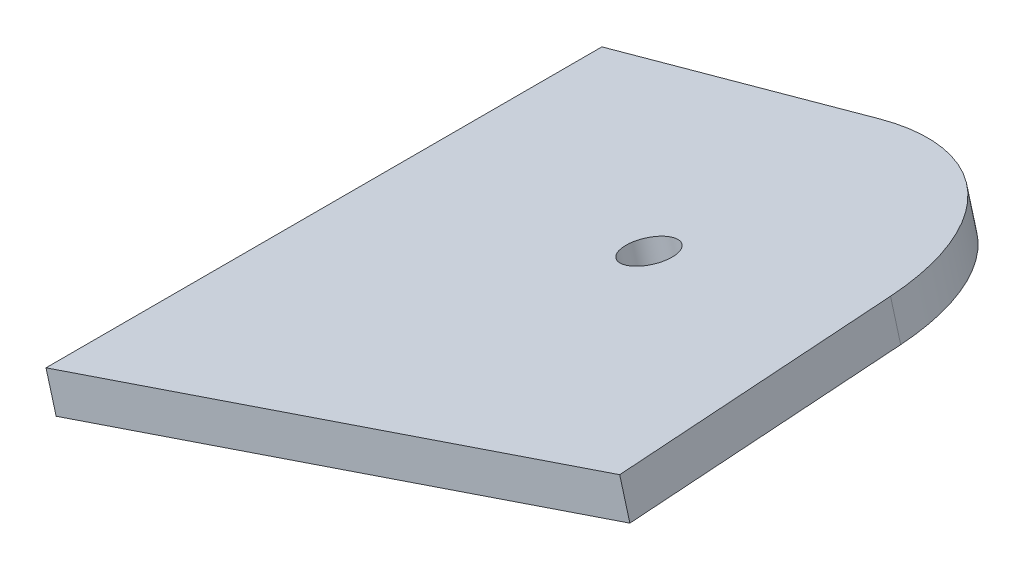
ISO-10303-21;
HEADER;
FILE_DESCRIPTION(('STEP AP214'),'2;1');
FILE_NAME('part.step','',(''),(''),'','','');
FILE_SCHEMA(('AUTOMOTIVE_DESIGN { 1 0 10303 214 1 1 1 1 }'));
ENDSEC;
DATA;
#1=APPLICATION_CONTEXT('core data for automotive mechanical design processes');
#2=APPLICATION_PROTOCOL_DEFINITION('international standard','automotive_design',2000,#1);
#3=PRODUCT_CONTEXT('',#1,'mechanical');
#4=PRODUCT('Part','Part','',(#3));
#5=PRODUCT_RELATED_PRODUCT_CATEGORY('part','',(#4));
#6=PRODUCT_DEFINITION_FORMATION('','',#4);
#7=PRODUCT_DEFINITION_CONTEXT('part definition',#1,'design');
#8=PRODUCT_DEFINITION('design','',#6,#7);
#9=PRODUCT_DEFINITION_SHAPE('','',#8);
#10=(LENGTH_UNIT() NAMED_UNIT(*) SI_UNIT(.MILLI.,.METRE.));
#11=(NAMED_UNIT(*) PLANE_ANGLE_UNIT() SI_UNIT($,.RADIAN.));
#12=(NAMED_UNIT(*) SI_UNIT($,.STERADIAN.) SOLID_ANGLE_UNIT());
#13=UNCERTAINTY_MEASURE_WITH_UNIT(LENGTH_MEASURE(1.E-05),#10,'distance_accuracy_value','');
#14=(GEOMETRIC_REPRESENTATION_CONTEXT(3) GLOBAL_UNCERTAINTY_ASSIGNED_CONTEXT((#13)) GLOBAL_UNIT_ASSIGNED_CONTEXT((#10,
#11,#12)) REPRESENTATION_CONTEXT('',''));
#15=CARTESIAN_POINT('',(0.,0.,0.));
#16=DIRECTION('',(0.,0.,1.));
#17=DIRECTION('',(1.,0.,0.));
#18=AXIS2_PLACEMENT_3D('',#15,#16,#17);
#19=CARTESIAN_POINT('',(-530.471128500836,55.5710730553242,45.8045757603859));
#20=DIRECTION('',(-0.96003686260803,-0.264378698649397,0.0918320539582106));
#21=DIRECTION('',(0.265500568767691,-0.964110703178859,0.));
#22=AXIS2_PLACEMENT_3D('',#19,#20,#21);
#23=PLANE('',#22);
#24=DIRECTION('',(-0.0885362661160089,-0.0243814625570103,-0.995774509548129));
#25=VECTOR('',#24,1.);
#26=CARTESIAN_POINT('',(-529.796757056166,53.1222318692499,45.8045757603859));
#27=LINE('',#26,#25);
#28=CARTESIAN_POINT('',(-517.882221289095,56.4033032361896,179.808318299092));
#29=VERTEX_POINT('',#28);
#30=CARTESIAN_POINT('',(-519.636301793386,55.9202577000101,160.080033715925));
#31=VERTEX_POINT('',#30);
#32=EDGE_CURVE('E113',#29,#31,#27,.T.);
#33=ORIENTED_EDGE('',*,*,#32,.T.);
#34=DIRECTION('',(0.265500568767691,-0.964110703178859,0.));
#35=VECTOR('',#34,1.);
#36=CARTESIAN_POINT('',(-520.310673238056,58.3690988860844,160.080033715925));
#37=LINE('',#36,#35);
#38=CARTESIAN_POINT('',(-520.310673238056,58.3690988860844,160.080033715925));
#39=VERTEX_POINT('',#38);
#40=EDGE_CURVE('E11',#39,#31,#37,.T.);
#41=ORIENTED_EDGE('',*,*,#40,.F.);
#42=DIRECTION('',(-0.0885362661160089,-0.0243814625570103,-0.995774509548129));
#43=VECTOR('',#42,1.);
#44=CARTESIAN_POINT('',(-530.471128500836,55.5710730553242,45.8045757603859));
#45=LINE('',#44,#43);
#46=CARTESIAN_POINT('',(-518.556592733765,58.8521444222639,179.808318299092));
#47=VERTEX_POINT('',#46);
#48=EDGE_CURVE('E130',#47,#39,#45,.T.);
#49=ORIENTED_EDGE('',*,*,#48,.F.);
#50=DIRECTION('',(0.265500568767691,-0.964110703178859,0.));
#51=VECTOR('',#50,1.);
#52=CARTESIAN_POINT('',(-518.556592733765,58.8521444222639,179.808318299092));
#53=LINE('',#52,#51);
#54=EDGE_CURVE('E106',#47,#29,#53,.T.);
#55=ORIENTED_EDGE('',*,*,#54,.T.);
#56=EDGE_LOOP('',(#33,#41,#49,#55));
#57=FACE_BOUND('',#56,.T.);
#58=ADVANCED_FACE('F36',(#57),#23,.F.);
#59=CARTESIAN_POINT('',(-534.941635024202,54.3399675186675,161.479554218248));
#60=DIRECTION('',(0.265500568767691,-0.964110703178859,0.));
#61=DIRECTION('',(0.964110703178859,0.265500568767691,0.));
#62=AXIS2_PLACEMENT_3D('',#59,#60,#61);
#63=CYLINDRICAL_SURFACE('',#62,15.2400000000002);
#64=CARTESIAN_POINT('',(-534.267263579532,51.8911263325932,161.479554218248));
#65=DIRECTION('',(-0.265500568767691,0.964110703178859,0.));
#66=DIRECTION('',(-0.964110703178859,-0.265500568767691,0.));
#67=AXIS2_PLACEMENT_3D('',#64,#65,#66);
#68=CIRCLE('',#67,15.2400000000002);
#69=CARTESIAN_POINT('',(-534.267263579532,51.8911263325932,146.239554218248));
#70=VERTEX_POINT('',#69);
#71=EDGE_CURVE('E116',#31,#70,#68,.T.);
#72=ORIENTED_EDGE('',*,*,#71,.T.);
#73=DIRECTION('',(0.265500568767691,-0.964110703178859,0.));
#74=VECTOR('',#73,1.);
#75=CARTESIAN_POINT('',(-534.941635024202,54.3399675186675,146.239554218248));
#76=LINE('',#75,#74);
#77=CARTESIAN_POINT('',(-534.941635024202,54.3399675186675,146.239554218248));
#78=VERTEX_POINT('',#77);
#79=EDGE_CURVE('E45',#78,#70,#76,.T.);
#80=ORIENTED_EDGE('',*,*,#79,.F.);
#81=CARTESIAN_POINT('',(-534.941635024202,54.3399675186675,161.479554218248));
#82=DIRECTION('',(-0.265500568767691,0.964110703178859,0.));
#83=DIRECTION('',(-0.964110703178859,-0.265500568767691,0.));
#84=AXIS2_PLACEMENT_3D('',#81,#82,#83);
#85=CIRCLE('',#84,15.2400000000002);
#86=EDGE_CURVE('E83',#39,#78,#85,.T.);
#87=ORIENTED_EDGE('',*,*,#86,.F.);
#88=ORIENTED_EDGE('',*,*,#40,.T.);
#89=EDGE_LOOP('',(#72,#80,#87,#88));
#90=FACE_BOUND('',#89,.T.);
#91=ADVANCED_FACE('F144',(#90),#63,.T.);
#92=CARTESIAN_POINT('',(-51.6178380571328,187.439561341879,146.239554218246));
#93=DIRECTION('',(0.,0.,1.));
#94=DIRECTION('',(1.,0.,0.));
#95=AXIS2_PLACEMENT_3D('',#92,#93,#94);
#96=PLANE('',#95);
#97=DIRECTION('',(-0.964110703178859,-0.265500568767691,0.));
#98=VECTOR('',#97,1.);
#99=CARTESIAN_POINT('',(-50.9434666124628,184.990720155805,146.239554218246));
#100=LINE('',#99,#98);
#101=CARTESIAN_POINT('',(-552.63357247509,46.8333404975687,146.239554218248));
#102=VERTEX_POINT('',#101);
#103=EDGE_CURVE('E99',#70,#102,#100,.T.);
#104=ORIENTED_EDGE('',*,*,#103,.T.);
#105=DIRECTION('',(0.265500568767691,-0.964110703178859,0.));
#106=VECTOR('',#105,1.);
#107=CARTESIAN_POINT('',(-553.30794391976,49.282181683643,146.239554218248));
#108=LINE('',#107,#106);
#109=CARTESIAN_POINT('',(-553.30794391976,49.282181683643,146.239554218248));
#110=VERTEX_POINT('',#109);
#111=EDGE_CURVE('E96',#110,#102,#108,.T.);
#112=ORIENTED_EDGE('',*,*,#111,.F.);
#113=DIRECTION('',(-0.964110703178859,-0.265500568767691,0.));
#114=VECTOR('',#113,1.);
#115=CARTESIAN_POINT('',(-51.6178380571328,187.439561341879,146.239554218246));
#116=LINE('',#115,#114);
#117=EDGE_CURVE('E87',#78,#110,#116,.T.);
#118=ORIENTED_EDGE('',*,*,#117,.F.);
#119=ORIENTED_EDGE('',*,*,#79,.T.);
#120=EDGE_LOOP('',(#104,#112,#118,#119));
#121=FACE_BOUND('',#120,.T.);
#122=ADVANCED_FACE('F97',(#121),#96,.F.);
#123=CARTESIAN_POINT('',(-553.30794391976,49.282181683643,0.));
#124=DIRECTION('',(-0.964110703178859,-0.265500568767691,0.));
#125=DIRECTION('',(0.265500568767691,-0.964110703178859,0.));
#126=AXIS2_PLACEMENT_3D('',#123,#124,#125);
#127=PLANE('',#126);
#128=DIRECTION('',(0.,0.,-1.));
#129=VECTOR('',#128,1.);
#130=CARTESIAN_POINT('',(-552.63357247509,46.8333404975687,0.));
#131=LINE('',#130,#129);
#132=CARTESIAN_POINT('',(-552.63357247509,46.8333404975687,183.13244894608));
#133=VERTEX_POINT('',#132);
#134=EDGE_CURVE('E119',#133,#102,#131,.T.);
#135=ORIENTED_EDGE('',*,*,#134,.F.);
#136=DIRECTION('',(0.265500568767691,-0.964110703178859,0.));
#137=VECTOR('',#136,1.);
#138=CARTESIAN_POINT('',(-553.30794391976,49.282181683643,183.13244894608));
#139=LINE('',#138,#137);
#140=CARTESIAN_POINT('',(-553.30794391976,49.282181683643,183.13244894608));
#141=VERTEX_POINT('',#140);
#142=EDGE_CURVE('E72',#141,#133,#139,.T.);
#143=ORIENTED_EDGE('',*,*,#142,.F.);
#144=DIRECTION('',(0.,0.,-1.));
#145=VECTOR('',#144,1.);
#146=CARTESIAN_POINT('',(-553.30794391976,49.282181683643,0.));
#147=LINE('',#146,#145);
#148=EDGE_CURVE('E91',#141,#110,#147,.T.);
#149=ORIENTED_EDGE('',*,*,#148,.T.);
#150=ORIENTED_EDGE('',*,*,#111,.T.);
#151=EDGE_LOOP('',(#135,#143,#149,#150));
#152=FACE_BOUND('',#151,.T.);
#153=ADVANCED_FACE('F104',(#152),#127,.T.);
#154=CARTESIAN_POINT('',(-534.941635024202,54.3399675186675,161.479554218248));
#155=DIRECTION('',(0.265500568767691,-0.964110703178859,0.));
#156=DIRECTION('',(0.964110703178859,0.265500568767691,0.));
#157=AXIS2_PLACEMENT_3D('',#154,#155,#156);
#158=CYLINDRICAL_SURFACE('',#157,1.58750000000036);
#159=CARTESIAN_POINT('',(-534.941635024202,54.3399675186675,161.479554218248));
#160=DIRECTION('',(-0.265500568767691,0.964110703178859,0.));
#161=DIRECTION('',(-0.964110703178859,-0.265500568767691,0.));
#162=AXIS2_PLACEMENT_3D('',#159,#160,#161);
#163=CIRCLE('',#162,1.58750000000036);
#164=CARTESIAN_POINT('',(-536.472160765499,53.9184853657487,161.479554218248));
#165=VERTEX_POINT('',#164);
#166=EDGE_CURVE('E122',#165,#165,#163,.T.);
#167=ORIENTED_EDGE('',*,*,#166,.T.);
#168=EDGE_LOOP('',(#167));
#169=FACE_BOUND('',#168,.T.);
#170=CARTESIAN_POINT('',(-534.267263579532,51.8911263325932,161.479554218248));
#171=DIRECTION('',(-0.265500568767691,0.964110703178859,0.));
#172=DIRECTION('',(-0.964110703178859,-0.265500568767691,0.));
#173=AXIS2_PLACEMENT_3D('',#170,#171,#172);
#174=CIRCLE('',#173,1.58750000000036);
#175=CARTESIAN_POINT('',(-535.797789320829,51.4696441796744,161.479554218248));
#176=VERTEX_POINT('',#175);
#177=EDGE_CURVE('E110',#176,#176,#174,.T.);
#178=ORIENTED_EDGE('',*,*,#177,.F.);
#179=EDGE_LOOP('',(#178));
#180=FACE_BOUND('',#179,.T.);
#181=ADVANCED_FACE('F38',(#169,#180),#158,.F.);
#182=CARTESIAN_POINT('',(-39.7033022900621,190.720632708819,134.003742538703));
#183=DIRECTION('',(-0.0885362661160153,-0.0243814625570119,-0.995774509548129));
#184=DIRECTION('',(-0.996070613494916,0.,0.0885625932991074));
#185=AXIS2_PLACEMENT_3D('',#182,#183,#184);
#186=PLANE('',#185);
#187=DIRECTION('',(0.960036862608029,0.264378698649397,-0.0918320539582173));
#188=VECTOR('',#187,1.);
#189=CARTESIAN_POINT('',(-39.0289308453923,188.271791522744,134.003742538703));
#190=LINE('',#189,#188);
#191=EDGE_CURVE('E75',#133,#29,#190,.T.);
#192=ORIENTED_EDGE('',*,*,#191,.T.);
#193=ORIENTED_EDGE('',*,*,#54,.F.);
#194=DIRECTION('',(0.960036862608029,0.264378698649397,-0.0918320539582173));
#195=VECTOR('',#194,1.);
#196=CARTESIAN_POINT('',(-39.7033022900621,190.720632708819,134.003742538703));
#197=LINE('',#196,#195);
#198=EDGE_CURVE('E53',#141,#47,#197,.T.);
#199=ORIENTED_EDGE('',*,*,#198,.F.);
#200=ORIENTED_EDGE('',*,*,#142,.T.);
#201=EDGE_LOOP('',(#192,#193,#199,#200));
#202=FACE_BOUND('',#201,.T.);
#203=ADVANCED_FACE('F131',(#202),#186,.F.);
#204=CARTESIAN_POINT('',(-51.617838057133,187.439561341879,-2.77555756156289E-13));
#205=DIRECTION('',(-0.265500568767691,0.964110703178859,0.));
#206=DIRECTION('',(-0.964110703178859,-0.265500568767691,0.));
#207=AXIS2_PLACEMENT_3D('',#204,#205,#206);
#208=PLANE('',#207);
#209=ORIENTED_EDGE('',*,*,#166,.F.);
#210=EDGE_LOOP('',(#209));
#211=FACE_BOUND('',#210,.T.);
#212=ORIENTED_EDGE('',*,*,#48,.T.);
#213=ORIENTED_EDGE('',*,*,#86,.T.);
#214=ORIENTED_EDGE('',*,*,#117,.T.);
#215=ORIENTED_EDGE('',*,*,#148,.F.);
#216=ORIENTED_EDGE('',*,*,#198,.T.);
#217=EDGE_LOOP('',(#212,#213,#214,#215,#216));
#218=FACE_BOUND('',#217,.T.);
#219=ADVANCED_FACE('F89',(#211,#218),#208,.T.);
#220=CARTESIAN_POINT('',(-50.9434666124634,184.990720155805,-2.77555756156289E-13));
#221=DIRECTION('',(-0.265500568767691,0.964110703178859,0.));
#222=DIRECTION('',(-0.964110703178859,-0.265500568767691,0.));
#223=AXIS2_PLACEMENT_3D('',#220,#221,#222);
#224=PLANE('',#223);
#225=ORIENTED_EDGE('',*,*,#177,.T.);
#226=EDGE_LOOP('',(#225));
#227=FACE_BOUND('',#226,.T.);
#228=ORIENTED_EDGE('',*,*,#32,.F.);
#229=ORIENTED_EDGE('',*,*,#191,.F.);
#230=ORIENTED_EDGE('',*,*,#134,.T.);
#231=ORIENTED_EDGE('',*,*,#103,.F.);
#232=ORIENTED_EDGE('',*,*,#71,.F.);
#233=EDGE_LOOP('',(#228,#229,#230,#231,#232));
#234=FACE_BOUND('',#233,.T.);
#235=ADVANCED_FACE('F126',(#227,#234),#224,.F.);
#236=CLOSED_SHELL('',(#58,#91,#122,#153,#181,#203,#219,#235));
#237=MANIFOLD_SOLID_BREP('B2',#236);
#238=ADVANCED_BREP_SHAPE_REPRESENTATION('',(#18,#237),#14);
#239=SHAPE_DEFINITION_REPRESENTATION(#9,#238);
ENDSEC;
END-ISO-10303-21;
